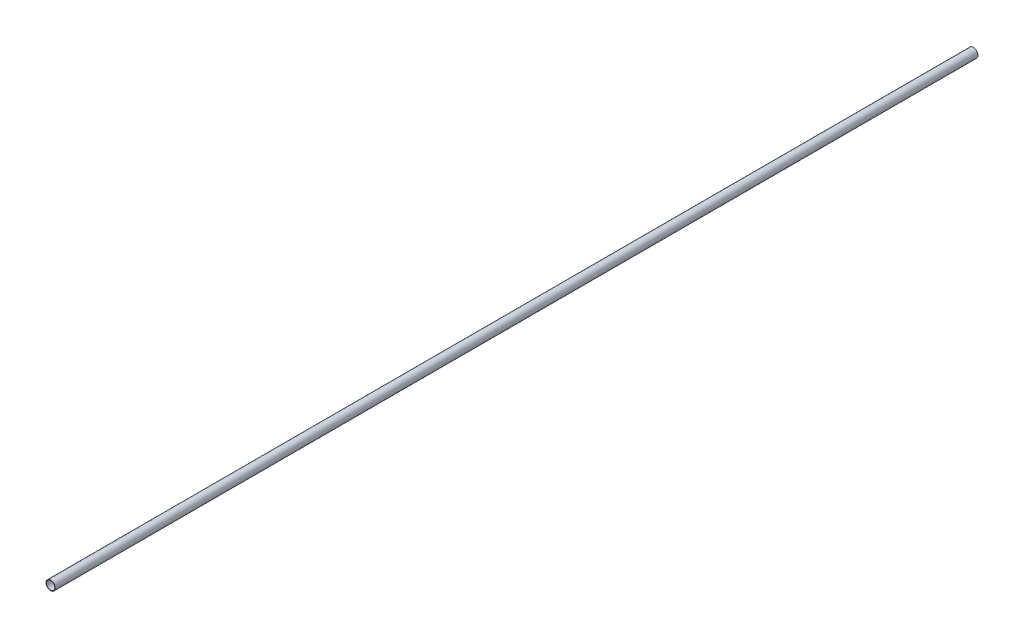
ISO-10303-21;
HEADER;
FILE_DESCRIPTION(('STEP AP214'),'2;1');
FILE_NAME('part.step','',(''),(''),'','','');
FILE_SCHEMA(('AUTOMOTIVE_DESIGN { 1 0 10303 214 1 1 1 1 }'));
ENDSEC;
DATA;
#1=APPLICATION_CONTEXT('core data for automotive mechanical design processes');
#2=APPLICATION_PROTOCOL_DEFINITION('international standard','automotive_design',2000,#1);
#3=PRODUCT_CONTEXT('',#1,'mechanical');
#4=PRODUCT('Part','Part','',(#3));
#5=PRODUCT_RELATED_PRODUCT_CATEGORY('part','',(#4));
#6=PRODUCT_DEFINITION_FORMATION('','',#4);
#7=PRODUCT_DEFINITION_CONTEXT('part definition',#1,'design');
#8=PRODUCT_DEFINITION('design','',#6,#7);
#9=PRODUCT_DEFINITION_SHAPE('','',#8);
#10=(LENGTH_UNIT() NAMED_UNIT(*) SI_UNIT(.MILLI.,.METRE.));
#11=(NAMED_UNIT(*) PLANE_ANGLE_UNIT() SI_UNIT($,.RADIAN.));
#12=(NAMED_UNIT(*) SI_UNIT($,.STERADIAN.) SOLID_ANGLE_UNIT());
#13=UNCERTAINTY_MEASURE_WITH_UNIT(LENGTH_MEASURE(1.E-05),#10,'distance_accuracy_value','');
#14=(GEOMETRIC_REPRESENTATION_CONTEXT(3) GLOBAL_UNCERTAINTY_ASSIGNED_CONTEXT((#13)) GLOBAL_UNIT_ASSIGNED_CONTEXT((#10,
#11,#12)) REPRESENTATION_CONTEXT('',''));
#15=CARTESIAN_POINT('',(0.,0.,0.));
#16=DIRECTION('',(0.,0.,1.));
#17=DIRECTION('',(1.,0.,0.));
#18=AXIS2_PLACEMENT_3D('',#15,#16,#17);
#19=CARTESIAN_POINT('',(0.,0.,500.));
#20=DIRECTION('',(0.,0.,1.));
#21=DIRECTION('',(1.,0.,0.));
#22=AXIS2_PLACEMENT_3D('',#19,#20,#21);
#23=PLANE('',#22);
#24=CARTESIAN_POINT('',(0.,0.,500.));
#25=DIRECTION('',(0.,0.,1.));
#26=DIRECTION('',(1.,0.,0.));
#27=AXIS2_PLACEMENT_3D('',#24,#25,#26);
#28=CIRCLE('',#27,5.);
#29=CARTESIAN_POINT('',(5.,0.,500.));
#30=VERTEX_POINT('',#29);
#31=EDGE_CURVE('E10',#30,#30,#28,.T.);
#32=ORIENTED_EDGE('',*,*,#31,.T.);
#33=EDGE_LOOP('',(#32));
#34=FACE_BOUND('',#33,.T.);
#35=CARTESIAN_POINT('',(0.,0.,500.));
#36=DIRECTION('',(0.,0.,1.));
#37=DIRECTION('',(1.,0.,0.));
#38=AXIS2_PLACEMENT_3D('',#35,#36,#37);
#39=CIRCLE('',#38,4.5);
#40=CARTESIAN_POINT('',(4.5,0.,500.));
#41=VERTEX_POINT('',#40);
#42=EDGE_CURVE('E50',#41,#41,#39,.T.);
#43=ORIENTED_EDGE('',*,*,#42,.F.);
#44=EDGE_LOOP('',(#43));
#45=FACE_BOUND('',#44,.T.);
#46=ADVANCED_FACE('F37',(#34,#45),#23,.T.);
#47=CARTESIAN_POINT('',(0.,0.,-500.));
#48=DIRECTION('',(0.,0.,1.));
#49=DIRECTION('',(1.,0.,0.));
#50=AXIS2_PLACEMENT_3D('',#47,#48,#49);
#51=PLANE('',#50);
#52=CARTESIAN_POINT('',(0.,0.,-500.));
#53=DIRECTION('',(0.,0.,1.));
#54=DIRECTION('',(1.,0.,0.));
#55=AXIS2_PLACEMENT_3D('',#52,#53,#54);
#56=CIRCLE('',#55,5.);
#57=CARTESIAN_POINT('',(5.,0.,-500.));
#58=VERTEX_POINT('',#57);
#59=EDGE_CURVE('E41',#58,#58,#56,.T.);
#60=ORIENTED_EDGE('',*,*,#59,.F.);
#61=EDGE_LOOP('',(#60));
#62=FACE_BOUND('',#61,.T.);
#63=CARTESIAN_POINT('',(0.,0.,-500.));
#64=DIRECTION('',(0.,0.,1.));
#65=DIRECTION('',(1.,0.,0.));
#66=AXIS2_PLACEMENT_3D('',#63,#64,#65);
#67=CIRCLE('',#66,4.5);
#68=CARTESIAN_POINT('',(4.5,0.,-500.));
#69=VERTEX_POINT('',#68);
#70=EDGE_CURVE('E52',#69,#69,#67,.T.);
#71=ORIENTED_EDGE('',*,*,#70,.T.);
#72=EDGE_LOOP('',(#71));
#73=FACE_BOUND('',#72,.T.);
#74=ADVANCED_FACE('F64',(#62,#73),#51,.F.);
#75=CARTESIAN_POINT('',(0.,0.,500.));
#76=DIRECTION('',(0.,0.,-1.));
#77=DIRECTION('',(-1.,0.,0.));
#78=AXIS2_PLACEMENT_3D('',#75,#76,#77);
#79=CYLINDRICAL_SURFACE('',#78,5.);
#80=ORIENTED_EDGE('',*,*,#31,.F.);
#81=EDGE_LOOP('',(#80));
#82=FACE_BOUND('',#81,.T.);
#83=ORIENTED_EDGE('',*,*,#59,.T.);
#84=EDGE_LOOP('',(#83));
#85=FACE_BOUND('',#84,.T.);
#86=ADVANCED_FACE('F39',(#82,#85),#79,.T.);
#87=CARTESIAN_POINT('',(0.,0.,500.));
#88=DIRECTION('',(0.,0.,-1.));
#89=DIRECTION('',(-1.,0.,0.));
#90=AXIS2_PLACEMENT_3D('',#87,#88,#89);
#91=CYLINDRICAL_SURFACE('',#90,4.5);
#92=ORIENTED_EDGE('',*,*,#42,.T.);
#93=EDGE_LOOP('',(#92));
#94=FACE_BOUND('',#93,.T.);
#95=ORIENTED_EDGE('',*,*,#70,.F.);
#96=EDGE_LOOP('',(#95));
#97=FACE_BOUND('',#96,.T.);
#98=ADVANCED_FACE('F60',(#94,#97),#91,.F.);
#99=CLOSED_SHELL('',(#46,#74,#86,#98));
#100=MANIFOLD_SOLID_BREP('B2',#99);
#101=ADVANCED_BREP_SHAPE_REPRESENTATION('',(#18,#100),#14);
#102=SHAPE_DEFINITION_REPRESENTATION(#9,#101);
ENDSEC;
END-ISO-10303-21;
